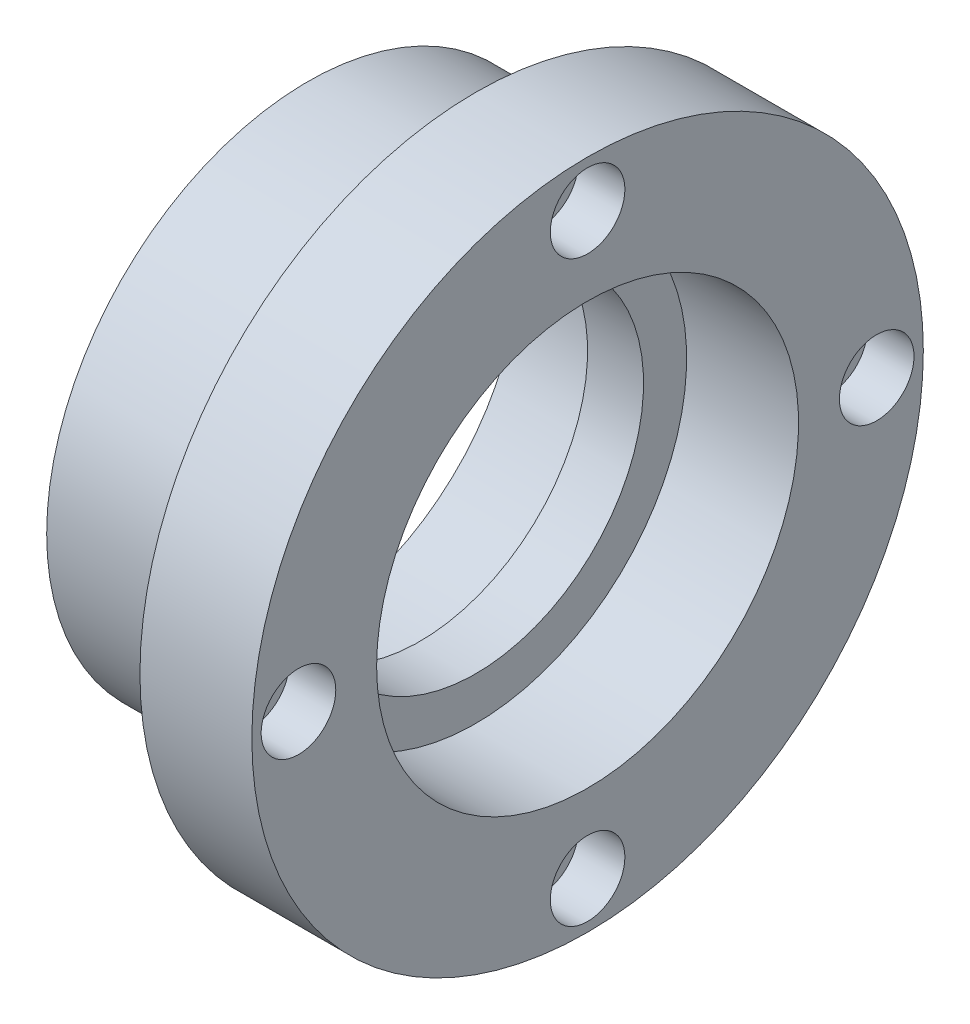
ISO-10303-21;
HEADER;
FILE_DESCRIPTION(('STEP AP214'),'2;1');
FILE_NAME('part.step','',(''),(''),'','','');
FILE_SCHEMA(('AUTOMOTIVE_DESIGN { 1 0 10303 214 1 1 1 1 }'));
ENDSEC;
DATA;
#1=APPLICATION_CONTEXT('core data for automotive mechanical design processes');
#2=APPLICATION_PROTOCOL_DEFINITION('international standard','automotive_design',2000,#1);
#3=PRODUCT_CONTEXT('',#1,'mechanical');
#4=PRODUCT('Part','Part','',(#3));
#5=PRODUCT_RELATED_PRODUCT_CATEGORY('part','',(#4));
#6=PRODUCT_DEFINITION_FORMATION('','',#4);
#7=PRODUCT_DEFINITION_CONTEXT('part definition',#1,'design');
#8=PRODUCT_DEFINITION('design','',#6,#7);
#9=PRODUCT_DEFINITION_SHAPE('','',#8);
#10=(LENGTH_UNIT() NAMED_UNIT(*) SI_UNIT(.MILLI.,.METRE.));
#11=(NAMED_UNIT(*) PLANE_ANGLE_UNIT() SI_UNIT($,.RADIAN.));
#12=(NAMED_UNIT(*) SI_UNIT($,.STERADIAN.) SOLID_ANGLE_UNIT());
#13=UNCERTAINTY_MEASURE_WITH_UNIT(LENGTH_MEASURE(1.E-05),#10,'distance_accuracy_value','');
#14=(GEOMETRIC_REPRESENTATION_CONTEXT(3) GLOBAL_UNCERTAINTY_ASSIGNED_CONTEXT((#13)) GLOBAL_UNIT_ASSIGNED_CONTEXT((#10,
#11,#12)) REPRESENTATION_CONTEXT('',''));
#15=CARTESIAN_POINT('',(0.,0.,0.));
#16=DIRECTION('',(0.,0.,1.));
#17=DIRECTION('',(1.,0.,0.));
#18=AXIS2_PLACEMENT_3D('',#15,#16,#17);
#19=CARTESIAN_POINT('',(-30.,28.,0.));
#20=DIRECTION('',(1.,0.,0.));
#21=DIRECTION('',(0.,0.,-1.));
#22=AXIS2_PLACEMENT_3D('',#19,#20,#21);
#23=PLANE('',#22);
#24=CARTESIAN_POINT('',(-30.,0.,0.));
#25=DIRECTION('',(-1.,0.,0.));
#26=DIRECTION('',(0.,0.,1.));
#27=AXIS2_PLACEMENT_3D('',#24,#25,#26);
#28=CIRCLE('',#27,22.621875);
#29=CARTESIAN_POINT('',(-30.,0.,22.621875));
#30=VERTEX_POINT('',#29);
#31=EDGE_CURVE('E10',#30,#30,#28,.T.);
#32=ORIENTED_EDGE('',*,*,#31,.F.);
#33=EDGE_LOOP('',(#32));
#34=FACE_BOUND('',#33,.T.);
#35=CARTESIAN_POINT('',(-30.,0.,0.));
#36=DIRECTION('',(-1.,0.,0.));
#37=DIRECTION('',(0.,0.,1.));
#38=AXIS2_PLACEMENT_3D('',#35,#36,#37);
#39=CIRCLE('',#38,28.);
#40=CARTESIAN_POINT('',(-30.,0.,28.));
#41=VERTEX_POINT('',#40);
#42=EDGE_CURVE('E50',#41,#41,#39,.T.);
#43=ORIENTED_EDGE('',*,*,#42,.T.);
#44=EDGE_LOOP('',(#43));
#45=FACE_BOUND('',#44,.T.);
#46=ADVANCED_FACE('F31',(#34,#45),#23,.F.);
#47=CARTESIAN_POINT('',(-59.7296875,0.,0.));
#48=DIRECTION('',(-1.,0.,0.));
#49=DIRECTION('',(0.,0.,1.));
#50=AXIS2_PLACEMENT_3D('',#47,#48,#49);
#51=CYLINDRICAL_SURFACE('',#50,22.621875);
#52=CARTESIAN_POINT('',(-18.,0.,0.));
#53=DIRECTION('',(-1.,0.,0.));
#54=DIRECTION('',(0.,0.,1.));
#55=AXIS2_PLACEMENT_3D('',#52,#53,#54);
#56=CIRCLE('',#55,22.621875);
#57=CARTESIAN_POINT('',(-18.,0.,22.621875));
#58=VERTEX_POINT('',#57);
#59=EDGE_CURVE('E38',#58,#58,#56,.T.);
#60=ORIENTED_EDGE('',*,*,#59,.F.);
#61=EDGE_LOOP('',(#60));
#62=FACE_BOUND('',#61,.T.);
#63=ORIENTED_EDGE('',*,*,#31,.T.);
#64=EDGE_LOOP('',(#63));
#65=FACE_BOUND('',#64,.T.);
#66=ADVANCED_FACE('F113',(#62,#65),#51,.F.);
#67=CARTESIAN_POINT('',(-18.,22.621875,0.));
#68=DIRECTION('',(1.,0.,0.));
#69=DIRECTION('',(0.,0.,-1.));
#70=AXIS2_PLACEMENT_3D('',#67,#68,#69);
#71=PLANE('',#70);
#72=CARTESIAN_POINT('',(-18.,0.,0.));
#73=DIRECTION('',(-1.,0.,0.));
#74=DIRECTION('',(0.,0.,1.));
#75=AXIS2_PLACEMENT_3D('',#72,#73,#74);
#76=CIRCLE('',#75,18.);
#77=CARTESIAN_POINT('',(-18.,0.,18.));
#78=VERTEX_POINT('',#77);
#79=EDGE_CURVE('E43',#78,#78,#76,.T.);
#80=ORIENTED_EDGE('',*,*,#79,.F.);
#81=EDGE_LOOP('',(#80));
#82=FACE_BOUND('',#81,.T.);
#83=ORIENTED_EDGE('',*,*,#59,.T.);
#84=EDGE_LOOP('',(#83));
#85=FACE_BOUND('',#84,.T.);
#86=ADVANCED_FACE('F110',(#82,#85),#71,.F.);
#87=CARTESIAN_POINT('',(-59.7296875,0.,0.));
#88=DIRECTION('',(-1.,0.,0.));
#89=DIRECTION('',(0.,0.,1.));
#90=AXIS2_PLACEMENT_3D('',#87,#88,#89);
#91=CYLINDRICAL_SURFACE('',#90,18.);
#92=CARTESIAN_POINT('',(-12.,0.,0.));
#93=DIRECTION('',(-1.,0.,0.));
#94=DIRECTION('',(0.,0.,1.));
#95=AXIS2_PLACEMENT_3D('',#92,#93,#94);
#96=CIRCLE('',#95,18.);
#97=CARTESIAN_POINT('',(-12.,0.,18.));
#98=VERTEX_POINT('',#97);
#99=EDGE_CURVE('E103',#98,#98,#96,.T.);
#100=ORIENTED_EDGE('',*,*,#99,.F.);
#101=EDGE_LOOP('',(#100));
#102=FACE_BOUND('',#101,.T.);
#103=ORIENTED_EDGE('',*,*,#79,.T.);
#104=EDGE_LOOP('',(#103));
#105=FACE_BOUND('',#104,.T.);
#106=ADVANCED_FACE('F108',(#102,#105),#91,.F.);
#107=CARTESIAN_POINT('',(-12.,18.,0.));
#108=DIRECTION('',(-1.,0.,0.));
#109=DIRECTION('',(0.,0.,1.));
#110=AXIS2_PLACEMENT_3D('',#107,#108,#109);
#111=PLANE('',#110);
#112=CARTESIAN_POINT('',(-12.,0.,0.));
#113=DIRECTION('',(-1.,0.,0.));
#114=DIRECTION('',(0.,0.,1.));
#115=AXIS2_PLACEMENT_3D('',#112,#113,#114);
#116=CIRCLE('',#115,22.621875);
#117=CARTESIAN_POINT('',(-12.,0.,22.621875));
#118=VERTEX_POINT('',#117);
#119=EDGE_CURVE('E100',#118,#118,#116,.T.);
#120=ORIENTED_EDGE('',*,*,#119,.F.);
#121=EDGE_LOOP('',(#120));
#122=FACE_BOUND('',#121,.T.);
#123=ORIENTED_EDGE('',*,*,#99,.T.);
#124=EDGE_LOOP('',(#123));
#125=FACE_BOUND('',#124,.T.);
#126=ADVANCED_FACE('F125',(#122,#125),#111,.F.);
#127=CARTESIAN_POINT('',(-59.7296875,0.,0.));
#128=DIRECTION('',(-1.,0.,0.));
#129=DIRECTION('',(0.,0.,1.));
#130=AXIS2_PLACEMENT_3D('',#127,#128,#129);
#131=CYLINDRICAL_SURFACE('',#130,22.621875);
#132=CARTESIAN_POINT('',(0.,0.,0.));
#133=DIRECTION('',(-1.,0.,0.));
#134=DIRECTION('',(0.,0.,1.));
#135=AXIS2_PLACEMENT_3D('',#132,#133,#134);
#136=CIRCLE('',#135,22.621875);
#137=CARTESIAN_POINT('',(0.,0.,22.621875));
#138=VERTEX_POINT('',#137);
#139=EDGE_CURVE('E97',#138,#138,#136,.T.);
#140=ORIENTED_EDGE('',*,*,#139,.F.);
#141=EDGE_LOOP('',(#140));
#142=FACE_BOUND('',#141,.T.);
#143=ORIENTED_EDGE('',*,*,#119,.T.);
#144=EDGE_LOOP('',(#143));
#145=FACE_BOUND('',#144,.T.);
#146=ADVANCED_FACE('F129',(#142,#145),#131,.F.);
#147=CARTESIAN_POINT('',(0.,22.621875,0.));
#148=DIRECTION('',(-1.,0.,0.));
#149=DIRECTION('',(0.,0.,1.));
#150=AXIS2_PLACEMENT_3D('',#147,#148,#149);
#151=PLANE('',#150);
#152=CARTESIAN_POINT('',(0.,3.24707764512411E-13,31.));
#153=DIRECTION('',(1.,0.,0.));
#154=DIRECTION('',(0.,0.,-1.));
#155=AXIS2_PLACEMENT_3D('',#152,#153,#154);
#156=CIRCLE('',#155,3.99999999999999);
#157=CARTESIAN_POINT('',(0.,3.24707764512411E-13,27.));
#158=VERTEX_POINT('',#157);
#159=EDGE_CURVE('E204',#158,#158,#156,.T.);
#160=ORIENTED_EDGE('',*,*,#159,.F.);
#161=EDGE_LOOP('',(#160));
#162=FACE_BOUND('',#161,.T.);
#163=CARTESIAN_POINT('',(0.,-31.,0.));
#164=DIRECTION('',(1.,0.,0.));
#165=DIRECTION('',(0.,0.,-1.));
#166=AXIS2_PLACEMENT_3D('',#163,#164,#165);
#167=CIRCLE('',#166,3.99999999999999);
#168=CARTESIAN_POINT('',(0.,-31.,-3.99999999999999));
#169=VERTEX_POINT('',#168);
#170=EDGE_CURVE('E71',#169,#169,#167,.T.);
#171=ORIENTED_EDGE('',*,*,#170,.F.);
#172=EDGE_LOOP('',(#171));
#173=FACE_BOUND('',#172,.T.);
#174=CARTESIAN_POINT('',(0.,-1.08235921504137E-13,-31.));
#175=DIRECTION('',(1.,0.,0.));
#176=DIRECTION('',(0.,0.,-1.));
#177=AXIS2_PLACEMENT_3D('',#174,#175,#176);
#178=CIRCLE('',#177,3.99999999999999);
#179=CARTESIAN_POINT('',(0.,-1.08235921504137E-13,-35.));
#180=VERTEX_POINT('',#179);
#181=EDGE_CURVE('E58',#180,#180,#178,.T.);
#182=ORIENTED_EDGE('',*,*,#181,.F.);
#183=EDGE_LOOP('',(#182));
#184=FACE_BOUND('',#183,.T.);
#185=CARTESIAN_POINT('',(0.,31.,0.));
#186=DIRECTION('',(1.,0.,0.));
#187=DIRECTION('',(0.,0.,-1.));
#188=AXIS2_PLACEMENT_3D('',#185,#186,#187);
#189=CIRCLE('',#188,3.99999999999999);
#190=CARTESIAN_POINT('',(0.,31.,-3.99999999999999));
#191=VERTEX_POINT('',#190);
#192=EDGE_CURVE('E54',#191,#191,#189,.T.);
#193=ORIENTED_EDGE('',*,*,#192,.F.);
#194=EDGE_LOOP('',(#193));
#195=FACE_BOUND('',#194,.T.);
#196=CARTESIAN_POINT('',(0.,0.,0.));
#197=DIRECTION('',(-1.,0.,0.));
#198=DIRECTION('',(0.,0.,1.));
#199=AXIS2_PLACEMENT_3D('',#196,#197,#198);
#200=CIRCLE('',#199,36.);
#201=CARTESIAN_POINT('',(0.,0.,36.));
#202=VERTEX_POINT('',#201);
#203=EDGE_CURVE('E94',#202,#202,#200,.T.);
#204=ORIENTED_EDGE('',*,*,#203,.F.);
#205=EDGE_LOOP('',(#204));
#206=FACE_BOUND('',#205,.T.);
#207=ORIENTED_EDGE('',*,*,#139,.T.);
#208=EDGE_LOOP('',(#207));
#209=FACE_BOUND('',#208,.T.);
#210=ADVANCED_FACE('F133',(#162,#173,#184,#195,#206,#209),#151,.F.);
#211=CARTESIAN_POINT('',(-59.7296875,0.,0.));
#212=DIRECTION('',(-1.,0.,0.));
#213=DIRECTION('',(0.,0.,1.));
#214=AXIS2_PLACEMENT_3D('',#211,#212,#213);
#215=CYLINDRICAL_SURFACE('',#214,36.);
#216=CARTESIAN_POINT('',(-12.,0.,0.));
#217=DIRECTION('',(-1.,0.,0.));
#218=DIRECTION('',(0.,0.,1.));
#219=AXIS2_PLACEMENT_3D('',#216,#217,#218);
#220=CIRCLE('',#219,36.);
#221=CARTESIAN_POINT('',(-12.,0.,36.));
#222=VERTEX_POINT('',#221);
#223=EDGE_CURVE('E91',#222,#222,#220,.T.);
#224=ORIENTED_EDGE('',*,*,#223,.F.);
#225=EDGE_LOOP('',(#224));
#226=FACE_BOUND('',#225,.T.);
#227=ORIENTED_EDGE('',*,*,#203,.T.);
#228=EDGE_LOOP('',(#227));
#229=FACE_BOUND('',#228,.T.);
#230=ADVANCED_FACE('F137',(#226,#229),#215,.T.);
#231=CARTESIAN_POINT('',(-12.,36.,0.));
#232=DIRECTION('',(1.,0.,0.));
#233=DIRECTION('',(0.,0.,-1.));
#234=AXIS2_PLACEMENT_3D('',#231,#232,#233);
#235=PLANE('',#234);
#236=CARTESIAN_POINT('',(-12.,3.24707764512411E-13,31.));
#237=DIRECTION('',(1.,0.,0.));
#238=DIRECTION('',(0.,0.,-1.));
#239=AXIS2_PLACEMENT_3D('',#236,#237,#238);
#240=CIRCLE('',#239,2.25);
#241=CARTESIAN_POINT('',(-12.,3.24707764512411E-13,28.75));
#242=VERTEX_POINT('',#241);
#243=EDGE_CURVE('E34',#242,#242,#240,.T.);
#244=ORIENTED_EDGE('',*,*,#243,.T.);
#245=EDGE_LOOP('',(#244));
#246=FACE_BOUND('',#245,.T.);
#247=CARTESIAN_POINT('',(-12.,-31.,0.));
#248=DIRECTION('',(1.,0.,0.));
#249=DIRECTION('',(0.,0.,-1.));
#250=AXIS2_PLACEMENT_3D('',#247,#248,#249);
#251=CIRCLE('',#250,2.25);
#252=CARTESIAN_POINT('',(-12.,-31.,-2.25));
#253=VERTEX_POINT('',#252);
#254=EDGE_CURVE('E56',#253,#253,#251,.T.);
#255=ORIENTED_EDGE('',*,*,#254,.T.);
#256=EDGE_LOOP('',(#255));
#257=FACE_BOUND('',#256,.T.);
#258=CARTESIAN_POINT('',(-12.,-1.08235921504137E-13,-31.));
#259=DIRECTION('',(1.,0.,0.));
#260=DIRECTION('',(0.,0.,-1.));
#261=AXIS2_PLACEMENT_3D('',#258,#259,#260);
#262=CIRCLE('',#261,2.25);
#263=CARTESIAN_POINT('',(-12.,-1.08235921504137E-13,-33.25));
#264=VERTEX_POINT('',#263);
#265=EDGE_CURVE('E52',#264,#264,#262,.T.);
#266=ORIENTED_EDGE('',*,*,#265,.T.);
#267=EDGE_LOOP('',(#266));
#268=FACE_BOUND('',#267,.T.);
#269=CARTESIAN_POINT('',(-12.,31.,0.));
#270=DIRECTION('',(1.,0.,0.));
#271=DIRECTION('',(0.,0.,-1.));
#272=AXIS2_PLACEMENT_3D('',#269,#270,#271);
#273=CIRCLE('',#272,2.25);
#274=CARTESIAN_POINT('',(-12.,31.,-2.25));
#275=VERTEX_POINT('',#274);
#276=EDGE_CURVE('E47',#275,#275,#273,.T.);
#277=ORIENTED_EDGE('',*,*,#276,.T.);
#278=EDGE_LOOP('',(#277));
#279=FACE_BOUND('',#278,.T.);
#280=CARTESIAN_POINT('',(-12.,0.,0.));
#281=DIRECTION('',(-1.,0.,0.));
#282=DIRECTION('',(0.,0.,1.));
#283=AXIS2_PLACEMENT_3D('',#280,#281,#282);
#284=CIRCLE('',#283,28.);
#285=CARTESIAN_POINT('',(-12.,0.,28.));
#286=VERTEX_POINT('',#285);
#287=EDGE_CURVE('E88',#286,#286,#284,.T.);
#288=ORIENTED_EDGE('',*,*,#287,.F.);
#289=EDGE_LOOP('',(#288));
#290=FACE_BOUND('',#289,.T.);
#291=ORIENTED_EDGE('',*,*,#223,.T.);
#292=EDGE_LOOP('',(#291));
#293=FACE_BOUND('',#292,.T.);
#294=ADVANCED_FACE('F141',(#246,#257,#268,#279,#290,#293),#235,.F.);
#295=CARTESIAN_POINT('',(-59.7296875,0.,0.));
#296=DIRECTION('',(-1.,0.,0.));
#297=DIRECTION('',(0.,0.,1.));
#298=AXIS2_PLACEMENT_3D('',#295,#296,#297);
#299=CYLINDRICAL_SURFACE('',#298,28.);
#300=ORIENTED_EDGE('',*,*,#42,.F.);
#301=EDGE_LOOP('',(#300));
#302=FACE_BOUND('',#301,.T.);
#303=ORIENTED_EDGE('',*,*,#287,.T.);
#304=EDGE_LOOP('',(#303));
#305=FACE_BOUND('',#304,.T.);
#306=ADVANCED_FACE('F145',(#302,#305),#299,.T.);
#307=CARTESIAN_POINT('',(0.,31.,0.));
#308=DIRECTION('',(1.,0.,0.));
#309=DIRECTION('',(0.,0.,-1.));
#310=AXIS2_PLACEMENT_3D('',#307,#308,#309);
#311=CYLINDRICAL_SURFACE('',#310,2.25);
#312=CARTESIAN_POINT('',(-5.,31.,0.));
#313=DIRECTION('',(1.,0.,0.));
#314=DIRECTION('',(0.,0.,-1.));
#315=AXIS2_PLACEMENT_3D('',#312,#313,#314);
#316=CIRCLE('',#315,2.25);
#317=CARTESIAN_POINT('',(-5.,31.,-2.25));
#318=VERTEX_POINT('',#317);
#319=EDGE_CURVE('E51',#318,#318,#316,.T.);
#320=ORIENTED_EDGE('',*,*,#319,.T.);
#321=EDGE_LOOP('',(#320));
#322=FACE_BOUND('',#321,.T.);
#323=ORIENTED_EDGE('',*,*,#276,.F.);
#324=EDGE_LOOP('',(#323));
#325=FACE_BOUND('',#324,.T.);
#326=ADVANCED_FACE('F149',(#322,#325),#311,.F.);
#327=CARTESIAN_POINT('',(-5.,33.25,0.));
#328=DIRECTION('',(-1.,0.,0.));
#329=DIRECTION('',(0.,0.,1.));
#330=AXIS2_PLACEMENT_3D('',#327,#328,#329);
#331=PLANE('',#330);
#332=ORIENTED_EDGE('',*,*,#319,.F.);
#333=EDGE_LOOP('',(#332));
#334=FACE_BOUND('',#333,.T.);
#335=CARTESIAN_POINT('',(-5.,31.,0.));
#336=DIRECTION('',(1.,0.,0.));
#337=DIRECTION('',(0.,0.,-1.));
#338=AXIS2_PLACEMENT_3D('',#335,#336,#337);
#339=CIRCLE('',#338,4.);
#340=CARTESIAN_POINT('',(-5.,31.,-4.));
#341=VERTEX_POINT('',#340);
#342=EDGE_CURVE('E81',#341,#341,#339,.T.);
#343=ORIENTED_EDGE('',*,*,#342,.T.);
#344=EDGE_LOOP('',(#343));
#345=FACE_BOUND('',#344,.T.);
#346=ADVANCED_FACE('F153',(#334,#345),#331,.F.);
#347=CARTESIAN_POINT('',(0.,31.,0.));
#348=DIRECTION('',(1.,0.,0.));
#349=DIRECTION('',(0.,0.,-1.));
#350=AXIS2_PLACEMENT_3D('',#347,#348,#349);
#351=CYLINDRICAL_SURFACE('',#350,3.99999999999999);
#352=ORIENTED_EDGE('',*,*,#342,.F.);
#353=EDGE_LOOP('',(#352));
#354=FACE_BOUND('',#353,.T.);
#355=ORIENTED_EDGE('',*,*,#192,.T.);
#356=EDGE_LOOP('',(#355));
#357=FACE_BOUND('',#356,.T.);
#358=ADVANCED_FACE('F157',(#354,#357),#351,.F.);
#359=CARTESIAN_POINT('',(0.,-1.08235921504137E-13,-31.));
#360=DIRECTION('',(1.,0.,0.));
#361=DIRECTION('',(0.,0.,-1.));
#362=AXIS2_PLACEMENT_3D('',#359,#360,#361);
#363=CYLINDRICAL_SURFACE('',#362,2.25);
#364=CARTESIAN_POINT('',(-5.,-1.08235921504137E-13,-31.));
#365=DIRECTION('',(1.,0.,0.));
#366=DIRECTION('',(0.,0.,-1.));
#367=AXIS2_PLACEMENT_3D('',#364,#365,#366);
#368=CIRCLE('',#367,2.25);
#369=CARTESIAN_POINT('',(-5.,-1.08235921504137E-13,-33.25));
#370=VERTEX_POINT('',#369);
#371=EDGE_CURVE('E55',#370,#370,#368,.T.);
#372=ORIENTED_EDGE('',*,*,#371,.T.);
#373=EDGE_LOOP('',(#372));
#374=FACE_BOUND('',#373,.T.);
#375=ORIENTED_EDGE('',*,*,#265,.F.);
#376=EDGE_LOOP('',(#375));
#377=FACE_BOUND('',#376,.T.);
#378=ADVANCED_FACE('F161',(#374,#377),#363,.F.);
#379=CARTESIAN_POINT('',(-5.,2.24999999999989,-31.));
#380=DIRECTION('',(-1.,0.,0.));
#381=DIRECTION('',(0.,0.,1.));
#382=AXIS2_PLACEMENT_3D('',#379,#380,#381);
#383=PLANE('',#382);
#384=ORIENTED_EDGE('',*,*,#371,.F.);
#385=EDGE_LOOP('',(#384));
#386=FACE_BOUND('',#385,.T.);
#387=CARTESIAN_POINT('',(-5.,-1.08235921504137E-13,-31.));
#388=DIRECTION('',(1.,0.,0.));
#389=DIRECTION('',(0.,0.,-1.));
#390=AXIS2_PLACEMENT_3D('',#387,#388,#389);
#391=CIRCLE('',#390,4.);
#392=CARTESIAN_POINT('',(-5.,-1.08235921504137E-13,-35.));
#393=VERTEX_POINT('',#392);
#394=EDGE_CURVE('E63',#393,#393,#391,.T.);
#395=ORIENTED_EDGE('',*,*,#394,.T.);
#396=EDGE_LOOP('',(#395));
#397=FACE_BOUND('',#396,.T.);
#398=ADVANCED_FACE('F165',(#386,#397),#383,.F.);
#399=CARTESIAN_POINT('',(0.,-1.08235921504137E-13,-31.));
#400=DIRECTION('',(1.,0.,0.));
#401=DIRECTION('',(0.,0.,-1.));
#402=AXIS2_PLACEMENT_3D('',#399,#400,#401);
#403=CYLINDRICAL_SURFACE('',#402,3.99999999999999);
#404=ORIENTED_EDGE('',*,*,#394,.F.);
#405=EDGE_LOOP('',(#404));
#406=FACE_BOUND('',#405,.T.);
#407=ORIENTED_EDGE('',*,*,#181,.T.);
#408=EDGE_LOOP('',(#407));
#409=FACE_BOUND('',#408,.T.);
#410=ADVANCED_FACE('F169',(#406,#409),#403,.F.);
#411=CARTESIAN_POINT('',(0.,-31.,0.));
#412=DIRECTION('',(1.,0.,0.));
#413=DIRECTION('',(0.,0.,-1.));
#414=AXIS2_PLACEMENT_3D('',#411,#412,#413);
#415=CYLINDRICAL_SURFACE('',#414,2.25);
#416=CARTESIAN_POINT('',(-5.,-31.,0.));
#417=DIRECTION('',(1.,0.,0.));
#418=DIRECTION('',(0.,0.,-1.));
#419=AXIS2_PLACEMENT_3D('',#416,#417,#418);
#420=CIRCLE('',#419,2.25);
#421=CARTESIAN_POINT('',(-5.,-31.,-2.25));
#422=VERTEX_POINT('',#421);
#423=EDGE_CURVE('E59',#422,#422,#420,.T.);
#424=ORIENTED_EDGE('',*,*,#423,.T.);
#425=EDGE_LOOP('',(#424));
#426=FACE_BOUND('',#425,.T.);
#427=ORIENTED_EDGE('',*,*,#254,.F.);
#428=EDGE_LOOP('',(#427));
#429=FACE_BOUND('',#428,.T.);
#430=ADVANCED_FACE('F173',(#426,#429),#415,.F.);
#431=CARTESIAN_POINT('',(-5.,-28.75,0.));
#432=DIRECTION('',(-1.,0.,0.));
#433=DIRECTION('',(0.,0.,1.));
#434=AXIS2_PLACEMENT_3D('',#431,#432,#433);
#435=PLANE('',#434);
#436=ORIENTED_EDGE('',*,*,#423,.F.);
#437=EDGE_LOOP('',(#436));
#438=FACE_BOUND('',#437,.T.);
#439=CARTESIAN_POINT('',(-5.,-31.,0.));
#440=DIRECTION('',(1.,0.,0.));
#441=DIRECTION('',(0.,0.,-1.));
#442=AXIS2_PLACEMENT_3D('',#439,#440,#441);
#443=CIRCLE('',#442,4.);
#444=CARTESIAN_POINT('',(-5.,-31.,-4.));
#445=VERTEX_POINT('',#444);
#446=EDGE_CURVE('E66',#445,#445,#443,.T.);
#447=ORIENTED_EDGE('',*,*,#446,.T.);
#448=EDGE_LOOP('',(#447));
#449=FACE_BOUND('',#448,.T.);
#450=ADVANCED_FACE('F177',(#438,#449),#435,.F.);
#451=CARTESIAN_POINT('',(0.,-31.,0.));
#452=DIRECTION('',(1.,0.,0.));
#453=DIRECTION('',(0.,0.,-1.));
#454=AXIS2_PLACEMENT_3D('',#451,#452,#453);
#455=CYLINDRICAL_SURFACE('',#454,3.99999999999999);
#456=ORIENTED_EDGE('',*,*,#446,.F.);
#457=EDGE_LOOP('',(#456));
#458=FACE_BOUND('',#457,.T.);
#459=ORIENTED_EDGE('',*,*,#170,.T.);
#460=EDGE_LOOP('',(#459));
#461=FACE_BOUND('',#460,.T.);
#462=ADVANCED_FACE('F180',(#458,#461),#455,.F.);
#463=CARTESIAN_POINT('',(0.,3.24707764512411E-13,31.));
#464=DIRECTION('',(1.,0.,0.));
#465=DIRECTION('',(0.,0.,-1.));
#466=AXIS2_PLACEMENT_3D('',#463,#464,#465);
#467=CYLINDRICAL_SURFACE('',#466,2.25);
#468=CARTESIAN_POINT('',(-5.,3.24707764512411E-13,31.));
#469=DIRECTION('',(1.,0.,0.));
#470=DIRECTION('',(0.,0.,-1.));
#471=AXIS2_PLACEMENT_3D('',#468,#469,#470);
#472=CIRCLE('',#471,2.25);
#473=CARTESIAN_POINT('',(-5.,3.24707764512411E-13,28.75));
#474=VERTEX_POINT('',#473);
#475=EDGE_CURVE('E206',#474,#474,#472,.T.);
#476=ORIENTED_EDGE('',*,*,#475,.T.);
#477=EDGE_LOOP('',(#476));
#478=FACE_BOUND('',#477,.T.);
#479=ORIENTED_EDGE('',*,*,#243,.F.);
#480=EDGE_LOOP('',(#479));
#481=FACE_BOUND('',#480,.T.);
#482=ADVANCED_FACE('F184',(#478,#481),#467,.F.);
#483=CARTESIAN_POINT('',(-5.,2.25000000000032,31.));
#484=DIRECTION('',(-1.,0.,0.));
#485=DIRECTION('',(0.,0.,1.));
#486=AXIS2_PLACEMENT_3D('',#483,#484,#485);
#487=PLANE('',#486);
#488=ORIENTED_EDGE('',*,*,#475,.F.);
#489=EDGE_LOOP('',(#488));
#490=FACE_BOUND('',#489,.T.);
#491=CARTESIAN_POINT('',(-5.,3.24707764512411E-13,31.));
#492=DIRECTION('',(1.,0.,0.));
#493=DIRECTION('',(0.,0.,-1.));
#494=AXIS2_PLACEMENT_3D('',#491,#492,#493);
#495=CIRCLE('',#494,4.);
#496=CARTESIAN_POINT('',(-5.,3.24707764512411E-13,27.));
#497=VERTEX_POINT('',#496);
#498=EDGE_CURVE('E201',#497,#497,#495,.T.);
#499=ORIENTED_EDGE('',*,*,#498,.T.);
#500=EDGE_LOOP('',(#499));
#501=FACE_BOUND('',#500,.T.);
#502=ADVANCED_FACE('F188',(#490,#501),#487,.F.);
#503=CARTESIAN_POINT('',(0.,3.24707764512411E-13,31.));
#504=DIRECTION('',(1.,0.,0.));
#505=DIRECTION('',(0.,0.,-1.));
#506=AXIS2_PLACEMENT_3D('',#503,#504,#505);
#507=CYLINDRICAL_SURFACE('',#506,3.99999999999999);
#508=ORIENTED_EDGE('',*,*,#498,.F.);
#509=EDGE_LOOP('',(#508));
#510=FACE_BOUND('',#509,.T.);
#511=ORIENTED_EDGE('',*,*,#159,.T.);
#512=EDGE_LOOP('',(#511));
#513=FACE_BOUND('',#512,.T.);
#514=ADVANCED_FACE('F192',(#510,#513),#507,.F.);
#515=CLOSED_SHELL('',(#46,#66,#86,#106,#126,#146,#210,#230,#294,#306,#326,#346,#358,#378,#398,
#410,#430,#450,#462,#482,#502,#514));
#516=MANIFOLD_SOLID_BREP('B2',#515);
#517=ADVANCED_BREP_SHAPE_REPRESENTATION('',(#18,#516),#14);
#518=SHAPE_DEFINITION_REPRESENTATION(#9,#517);
ENDSEC;
END-ISO-10303-21;
